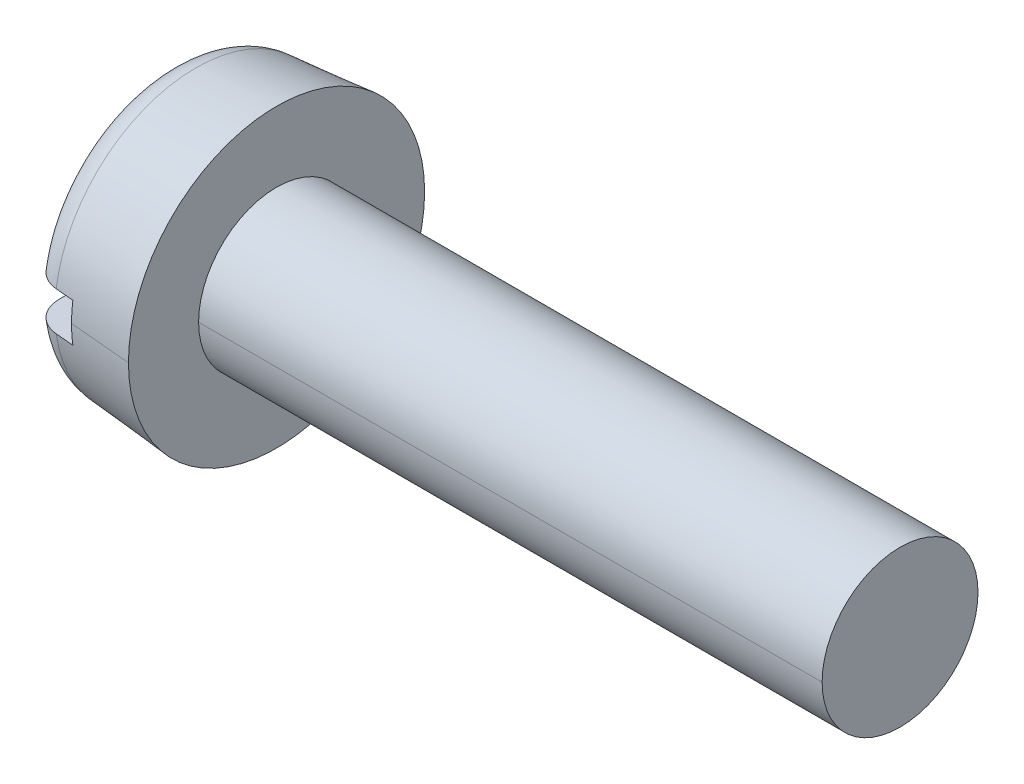
ISO-10303-21;
HEADER;
FILE_DESCRIPTION(('STEP AP214'),'2;1');
FILE_NAME('part.step','',(''),(''),'','','');
FILE_SCHEMA(('AUTOMOTIVE_DESIGN { 1 0 10303 214 1 1 1 1 }'));
ENDSEC;
DATA;
#1=APPLICATION_CONTEXT('core data for automotive mechanical design processes');
#2=APPLICATION_PROTOCOL_DEFINITION('international standard','automotive_design',2000,#1);
#3=PRODUCT_CONTEXT('',#1,'mechanical');
#4=PRODUCT('Part','Part','',(#3));
#5=PRODUCT_RELATED_PRODUCT_CATEGORY('part','',(#4));
#6=PRODUCT_DEFINITION_FORMATION('','',#4);
#7=PRODUCT_DEFINITION_CONTEXT('part definition',#1,'design');
#8=PRODUCT_DEFINITION('design','',#6,#7);
#9=PRODUCT_DEFINITION_SHAPE('','',#8);
#10=(LENGTH_UNIT() NAMED_UNIT(*) SI_UNIT(.MILLI.,.METRE.));
#11=(NAMED_UNIT(*) PLANE_ANGLE_UNIT() SI_UNIT($,.RADIAN.));
#12=(NAMED_UNIT(*) SI_UNIT($,.STERADIAN.) SOLID_ANGLE_UNIT());
#13=UNCERTAINTY_MEASURE_WITH_UNIT(LENGTH_MEASURE(1.E-05),#10,'distance_accuracy_value','');
#14=(GEOMETRIC_REPRESENTATION_CONTEXT(3) GLOBAL_UNCERTAINTY_ASSIGNED_CONTEXT((#13)) GLOBAL_UNIT_ASSIGNED_CONTEXT((#10,
#11,#12)) REPRESENTATION_CONTEXT('',''));
#15=CARTESIAN_POINT('',(0.,0.,0.));
#16=DIRECTION('',(0.,0.,1.));
#17=DIRECTION('',(1.,0.,0.));
#18=AXIS2_PLACEMENT_3D('',#15,#16,#17);
#19=CARTESIAN_POINT('',(0.6,-0.25,-1.9));
#20=DIRECTION('',(0.,-1.,0.));
#21=DIRECTION('',(0.,0.,-1.));
#22=AXIS2_PLACEMENT_3D('',#19,#20,#21);
#23=PLANE('',#22);
#24=CARTESIAN_POINT('',(0.365137702900937,-0.25,-1.79210773290244));
#25=CARTESIAN_POINT('',(0.291437131902306,-0.25,-1.78559733075897));
#26=CARTESIAN_POINT('',(0.22219649316851,-0.25,-1.7512156416243));
#27=CARTESIAN_POINT('',(0.155571204508869,-0.25,-1.71813261401084));
#28=CARTESIAN_POINT('',(0.104145980214715,-0.25,-1.66148344588308));
#29=CARTESIAN_POINT('',(0.0551789764167699,-0.25,-1.60754221239432));
#30=CARTESIAN_POINT('',(0.0271281505162559,-0.25,-1.53493574681391));
#31=CARTESIAN_POINT('',(0.,-0.25,-1.46471752458742));
#32=CARTESIAN_POINT('',(0.,-0.25,-1.38865912274626));
#33=B_SPLINE_CURVE_WITH_KNOTS('',2,(#24,#25,#26,#27,#28,#29,#30,#31,#32),.UNSPECIFIED.,.F.,.F.,
(3,2,2,2,3),(0.,0.25,0.5,0.75,1.),.UNSPECIFIED.);
#34=CARTESIAN_POINT('',(0.365137702900937,-0.25,-1.79210773290244));
#35=VERTEX_POINT('',#34);
#36=CARTESIAN_POINT('',(0.,-0.25,-1.38865912274626));
#37=VERTEX_POINT('',#36);
#38=EDGE_CURVE('E82',#35,#37,#33,.T.);
#39=ORIENTED_EDGE('',*,*,#38,.T.);
#40=DIRECTION('',(0.,0.,1.));
#41=VECTOR('',#40,1.);
#42=CARTESIAN_POINT('',(0.,-0.25,-1.9));
#43=LINE('',#42,#41);
#44=CARTESIAN_POINT('',(0.,-0.25,1.38865912274626));
#45=VERTEX_POINT('',#44);
#46=EDGE_CURVE('E121',#37,#45,#43,.T.);
#47=ORIENTED_EDGE('',*,*,#46,.T.);
#48=CARTESIAN_POINT('',(0.,-0.25,1.38865912274627));
#49=CARTESIAN_POINT('',(0.,-0.25,1.46315447616691));
#50=CARTESIAN_POINT('',(0.0270786285490139,-0.25,1.53498265899196));
#51=CARTESIAN_POINT('',(0.053283148473742,-0.25,1.60449220023733));
#52=CARTESIAN_POINT('',(0.104220023837533,-0.25,1.66156571297043));
#53=CARTESIAN_POINT('',(0.152903956736866,-0.25,1.71611485923006));
#54=CARTESIAN_POINT('',(0.222641905352023,-0.25,1.75136599302031));
#55=CARTESIAN_POINT('',(0.290134778658801,-0.25,1.78548228628779));
#56=CARTESIAN_POINT('',(0.365137702898777,-0.25,1.79210773291097));
#57=B_SPLINE_CURVE_WITH_KNOTS('',2,(#48,#49,#50,#51,#52,#53,#54,#55,#56),.UNSPECIFIED.,.F.,.F.,
(3,2,2,2,3),(0.,0.25,0.5,0.75,1.),.UNSPECIFIED.);
#58=CARTESIAN_POINT('',(0.365137702898778,-0.25,1.79210773291097));
#59=VERTEX_POINT('',#58);
#60=EDGE_CURVE('E137',#45,#59,#57,.T.);
#61=ORIENTED_EDGE('',*,*,#60,.T.);
#62=CARTESIAN_POINT('',(0.6,-0.25,1.8128522259904));
#63=CARTESIAN_POINT('',(0.549769017917673,-0.25,1.80841599358979));
#64=CARTESIAN_POINT('',(0.499538062464663,-0.25,1.8039794596575));
#65=CARTESIAN_POINT('',(0.449307134241759,-0.25,1.7995426174547));
#66=CARTESIAN_POINT('',(0.421250648596907,-0.25,1.79706441918173));
#67=CARTESIAN_POINT('',(0.393194171447115,-0.25,1.79458612473151));
#68=CARTESIAN_POINT('',(0.365137702898778,-0.25,1.79210773291097));
#69=(BOUNDED_CURVE() B_SPLINE_CURVE(3,(#62,#63,#64,#65,#66,#67,#68),.UNSPECIFIED.,.F.,
.F.) B_SPLINE_CURVE_WITH_KNOTS((4,3,4),(0.00319106621206755,0.00334234570568948,
0.00342684286890607),
.UNSPECIFIED.) CURVE() GEOMETRIC_REPRESENTATION_ITEM() RATIONAL_B_SPLINE_CURVE((1.,1.,1.,1.,1.,
1.,1.)) REPRESENTATION_ITEM(''));
#70=CARTESIAN_POINT('',(0.6,-0.25,1.8128522259904));
#71=VERTEX_POINT('',#70);
#72=EDGE_CURVE('E120',#71,#59,#69,.T.);
#73=ORIENTED_EDGE('',*,*,#72,.F.);
#74=DIRECTION('',(0.,0.,1.));
#75=VECTOR('',#74,1.);
#76=CARTESIAN_POINT('',(0.6,-0.25,-1.9));
#77=LINE('',#76,#75);
#78=CARTESIAN_POINT('',(0.6,-0.25,-1.8128522259904));
#79=VERTEX_POINT('',#78);
#80=EDGE_CURVE('E29',#79,#71,#77,.T.);
#81=ORIENTED_EDGE('',*,*,#80,.F.);
#82=CARTESIAN_POINT('',(0.365137702900937,-0.25,-1.79210773290244));
#83=CARTESIAN_POINT('',(0.393194171448044,-0.25,-1.7945861247316));
#84=CARTESIAN_POINT('',(0.421250648597372,-0.25,-1.79706441918177));
#85=CARTESIAN_POINT('',(0.449307134241759,-0.25,-1.7995426174547));
#86=CARTESIAN_POINT('',(0.499538062464663,-0.25,-1.8039794596575));
#87=CARTESIAN_POINT('',(0.549769017917673,-0.25,-1.80841599358979));
#88=CARTESIAN_POINT('',(0.6,-0.25,-1.8128522259904));
#89=(BOUNDED_CURVE() B_SPLINE_CURVE(3,(#82,#83,#84,#85,#86,#87,#88),.UNSPECIFIED.,.F.,
.F.) B_SPLINE_CURVE_WITH_KNOTS((4,3,4),(0.00325784856487656,0.00334234572775568,
0.00349362522084869),
.UNSPECIFIED.) CURVE() GEOMETRIC_REPRESENTATION_ITEM() RATIONAL_B_SPLINE_CURVE((1.,1.,1.,1.,1.,
1.,1.)) REPRESENTATION_ITEM(''));
#90=EDGE_CURVE('E134',#35,#79,#89,.T.);
#91=ORIENTED_EDGE('',*,*,#90,.F.);
#92=EDGE_LOOP('',(#39,#47,#61,#73,#81,#91));
#93=FACE_BOUND('',#92,.T.);
#94=ADVANCED_FACE('F16',(#93),#23,.F.);
#95=CARTESIAN_POINT('',(0.6,0.25,-1.9));
#96=DIRECTION('',(0.,1.,0.));
#97=DIRECTION('',(1.,0.,0.));
#98=AXIS2_PLACEMENT_3D('',#95,#96,#97);
#99=PLANE('',#98);
#100=DIRECTION('',(0.,0.,-1.));
#101=VECTOR('',#100,1.);
#102=CARTESIAN_POINT('',(0.6,0.25,-1.9));
#103=LINE('',#102,#101);
#104=CARTESIAN_POINT('',(0.6,0.25,1.8128522259904));
#105=VERTEX_POINT('',#104);
#106=CARTESIAN_POINT('',(0.6,0.25,-1.8128522259904));
#107=VERTEX_POINT('',#106);
#108=EDGE_CURVE('E11',#105,#107,#103,.T.);
#109=ORIENTED_EDGE('',*,*,#108,.F.);
#110=CARTESIAN_POINT('',(0.365137702900959,0.25,1.79210773290293));
#111=CARTESIAN_POINT('',(0.393194171448087,0.25,1.79458612473161));
#112=CARTESIAN_POINT('',(0.421250648597394,0.25,1.79706441918177));
#113=CARTESIAN_POINT('',(0.449307134241759,0.25,1.7995426174547));
#114=CARTESIAN_POINT('',(0.499538062464663,0.25,1.8039794596575));
#115=CARTESIAN_POINT('',(0.549769017917673,0.25,1.80841599358979));
#116=CARTESIAN_POINT('',(0.6,0.25,1.8128522259904));
#117=(BOUNDED_CURVE() B_SPLINE_CURVE(3,(#110,#111,#112,#113,#114,#115,#116),.UNSPECIFIED.,.F.,
.F.) B_SPLINE_CURVE_WITH_KNOTS((4,3,4),(0.00325784856487663,0.00334234572775568,
0.00349362522084869),
.UNSPECIFIED.) CURVE() GEOMETRIC_REPRESENTATION_ITEM() RATIONAL_B_SPLINE_CURVE((1.,1.,1.,1.,1.,
1.,1.)) REPRESENTATION_ITEM(''));
#118=CARTESIAN_POINT('',(0.365137702900959,0.25,1.79210773290293));
#119=VERTEX_POINT('',#118);
#120=EDGE_CURVE('E515',#119,#105,#117,.T.);
#121=ORIENTED_EDGE('',*,*,#120,.F.);
#122=CARTESIAN_POINT('',(0.365137702900959,0.25,1.79210773290293));
#123=CARTESIAN_POINT('',(0.29185798650255,0.25,1.78563450730545));
#124=CARTESIAN_POINT('',(0.222397826019831,0.25,1.75117859067216));
#125=CARTESIAN_POINT('',(0.155444181685095,0.25,1.71796603873648));
#126=CARTESIAN_POINT('',(0.104194373722597,0.25,1.66153721924653));
#127=CARTESIAN_POINT('',(0.0554327580786059,0.25,1.60784803451385));
#128=CARTESIAN_POINT('',(0.0272203643972849,0.25,1.53472414118304));
#129=CARTESIAN_POINT('',(0.,0.25,1.46417149523968));
#130=CARTESIAN_POINT('',(0.,0.25,1.38865912274627));
#131=B_SPLINE_CURVE_WITH_KNOTS('',2,(#122,#123,#124,#125,#126,#127,#128,#129,#130),
.UNSPECIFIED.,.F.,.F.,(3,2,2,2,3),(0.,0.25,0.5,0.75,1.),.UNSPECIFIED.);
#132=CARTESIAN_POINT('',(0.,0.25,1.38865912274626));
#133=VERTEX_POINT('',#132);
#134=EDGE_CURVE('E207',#119,#133,#131,.T.);
#135=ORIENTED_EDGE('',*,*,#134,.T.);
#136=DIRECTION('',(0.,0.,-1.));
#137=VECTOR('',#136,1.);
#138=CARTESIAN_POINT('',(0.,0.25,-1.9));
#139=LINE('',#138,#137);
#140=CARTESIAN_POINT('',(0.,0.25,-1.38865912274626));
#141=VERTEX_POINT('',#140);
#142=EDGE_CURVE('E553',#133,#141,#139,.T.);
#143=ORIENTED_EDGE('',*,*,#142,.T.);
#144=CARTESIAN_POINT('',(0.,0.25,-1.38865912274626));
#145=CARTESIAN_POINT('',(0.,0.25,-1.46251622227619));
#146=CARTESIAN_POINT('',(0.026960417168731,0.25,-1.5343648727742));
#147=CARTESIAN_POINT('',(0.053195686998227,0.25,-1.60428102877814));
#148=CARTESIAN_POINT('',(0.103966295066659,0.25,-1.66128361495215));
#149=CARTESIAN_POINT('',(0.152590985685726,0.25,-1.71587687712979));
#150=CARTESIAN_POINT('',(0.222580261018464,0.25,-1.75127465267984));
#151=CARTESIAN_POINT('',(0.290233625586207,0.25,-1.78549101801282));
#152=CARTESIAN_POINT('',(0.365137702900937,0.25,-1.79210773290244));
#153=B_SPLINE_CURVE_WITH_KNOTS('',2,(#144,#145,#146,#147,#148,#149,#150,#151,#152),
.UNSPECIFIED.,.F.,.F.,(3,2,2,2,3),(0.,0.25,0.5,0.75,1.),.UNSPECIFIED.);
#154=CARTESIAN_POINT('',(0.365137702900937,0.25,-1.79210773290244));
#155=VERTEX_POINT('',#154);
#156=EDGE_CURVE('E274',#141,#155,#153,.T.);
#157=ORIENTED_EDGE('',*,*,#156,.T.);
#158=CARTESIAN_POINT('',(0.6,0.25,-1.8128522259904));
#159=CARTESIAN_POINT('',(0.549769017917673,0.25,-1.80841599358979));
#160=CARTESIAN_POINT('',(0.499538062464663,0.25,-1.8039794596575));
#161=CARTESIAN_POINT('',(0.449307134241759,0.25,-1.7995426174547));
#162=CARTESIAN_POINT('',(0.421250648597372,0.25,-1.79706441918177));
#163=CARTESIAN_POINT('',(0.393194171448044,0.25,-1.7945861247316));
#164=CARTESIAN_POINT('',(0.365137702900937,0.25,-1.79210773290244));
#165=(BOUNDED_CURVE() B_SPLINE_CURVE(3,(#158,#159,#160,#161,#162,#163,#164),.UNSPECIFIED.,.F.,
.F.) B_SPLINE_CURVE_WITH_KNOTS((4,3,4),(0.00319106621206755,0.00334234570568948,
0.00342684286890468),
.UNSPECIFIED.) CURVE() GEOMETRIC_REPRESENTATION_ITEM() RATIONAL_B_SPLINE_CURVE((1.,1.,1.,1.,1.,
1.,1.)) REPRESENTATION_ITEM(''));
#166=EDGE_CURVE('E106',#107,#155,#165,.T.);
#167=ORIENTED_EDGE('',*,*,#166,.F.);
#168=EDGE_LOOP('',(#109,#121,#135,#143,#157,#167));
#169=FACE_BOUND('',#168,.T.);
#170=ADVANCED_FACE('F155',(#169),#99,.F.);
#171=CARTESIAN_POINT('',(0.6,-0.25,-1.9));
#172=DIRECTION('',(-1.,0.,0.));
#173=DIRECTION('',(0.,0.,1.));
#174=AXIS2_PLACEMENT_3D('',#171,#172,#173);
#175=PLANE('',#174);
#176=CARTESIAN_POINT('',(0.6,0.,0.));
#177=DIRECTION('',(-1.,0.,0.));
#178=DIRECTION('',(0.,0.,1.));
#179=AXIS2_PLACEMENT_3D('',#176,#177,#178);
#180=CIRCLE('',#179,1.83000906917926);
#181=CARTESIAN_POINT('',(0.6,0.,-1.83000906917926));
#182=VERTEX_POINT('',#181);
#183=EDGE_CURVE('E102',#107,#182,#180,.T.);
#184=ORIENTED_EDGE('',*,*,#183,.T.);
#185=CARTESIAN_POINT('',(0.6,0.,0.));
#186=DIRECTION('',(-1.,0.,0.));
#187=DIRECTION('',(0.,0.,1.));
#188=AXIS2_PLACEMENT_3D('',#185,#186,#187);
#189=CIRCLE('',#188,1.83000906917926);
#190=EDGE_CURVE('E126',#182,#79,#189,.T.);
#191=ORIENTED_EDGE('',*,*,#190,.T.);
#192=ORIENTED_EDGE('',*,*,#80,.T.);
#193=CARTESIAN_POINT('',(0.6,0.,0.));
#194=DIRECTION('',(-1.,0.,0.));
#195=DIRECTION('',(0.,0.,1.));
#196=AXIS2_PLACEMENT_3D('',#193,#194,#195);
#197=CIRCLE('',#196,1.83000906917926);
#198=CARTESIAN_POINT('',(0.6,0.,1.83000906917926));
#199=VERTEX_POINT('',#198);
#200=EDGE_CURVE('E116',#71,#199,#197,.T.);
#201=ORIENTED_EDGE('',*,*,#200,.T.);
#202=CARTESIAN_POINT('',(0.6,0.,0.));
#203=DIRECTION('',(-1.,0.,0.));
#204=DIRECTION('',(0.,0.,1.));
#205=AXIS2_PLACEMENT_3D('',#202,#203,#204);
#206=CIRCLE('',#205,1.83000906917926);
#207=EDGE_CURVE('E91',#199,#105,#206,.T.);
#208=ORIENTED_EDGE('',*,*,#207,.T.);
#209=ORIENTED_EDGE('',*,*,#108,.T.);
#210=EDGE_LOOP('',(#184,#191,#192,#201,#208,#209));
#211=FACE_BOUND('',#210,.T.);
#212=ADVANCED_FACE('F187',(#211),#175,.T.);
#213=CARTESIAN_POINT('',(0.4,0.,0.));
#214=DIRECTION('',(1.,0.,0.));
#215=DIRECTION('',(0.,0.,-1.));
#216=AXIS2_PLACEMENT_3D('',#213,#214,#215);
#217=TOROIDAL_SURFACE('',#216,1.41098340145674,0.4);
#218=ORIENTED_EDGE('',*,*,#38,.F.);
#219=CARTESIAN_POINT('',(0.365137702900937,0.,0.));
#220=DIRECTION('',(1.,0.,0.));
#221=DIRECTION('',(0.,0.,1.));
#222=AXIS2_PLACEMENT_3D('',#219,#220,#221);
#223=CIRCLE('',#222,1.80946128069343);
#224=EDGE_CURVE('E210',#59,#35,#223,.T.);
#225=ORIENTED_EDGE('',*,*,#224,.F.);
#226=ORIENTED_EDGE('',*,*,#60,.F.);
#227=CARTESIAN_POINT('',(0.,0.,0.));
#228=DIRECTION('',(-1.,0.,0.));
#229=DIRECTION('',(0.,0.,-1.));
#230=AXIS2_PLACEMENT_3D('',#227,#228,#229);
#231=CIRCLE('',#230,1.41098340145674);
#232=EDGE_CURVE('E201',#37,#45,#231,.T.);
#233=ORIENTED_EDGE('',*,*,#232,.F.);
#234=EDGE_LOOP('',(#218,#225,#226,#233));
#235=FACE_BOUND('',#234,.T.);
#236=ADVANCED_FACE('F178',(#235),#217,.T.);
#237=CARTESIAN_POINT('',(9.4,1.,0.));
#238=DIRECTION('',(-1.,0.,0.));
#239=DIRECTION('',(0.,0.,1.));
#240=AXIS2_PLACEMENT_3D('',#237,#238,#239);
#241=PLANE('',#240);
#242=CARTESIAN_POINT('',(9.4,0.,0.));
#243=DIRECTION('',(-1.,0.,0.));
#244=DIRECTION('',(0.,0.,1.));
#245=AXIS2_PLACEMENT_3D('',#242,#243,#244);
#246=CIRCLE('',#245,1.);
#247=CARTESIAN_POINT('',(9.4,0.,1.));
#248=VERTEX_POINT('',#247);
#249=CARTESIAN_POINT('',(9.4,0.,-1.));
#250=VERTEX_POINT('',#249);
#251=EDGE_CURVE('E87',#248,#250,#246,.T.);
#252=ORIENTED_EDGE('',*,*,#251,.F.);
#253=CARTESIAN_POINT('',(9.4,0.,0.));
#254=DIRECTION('',(-1.,0.,0.));
#255=DIRECTION('',(0.,0.,1.));
#256=AXIS2_PLACEMENT_3D('',#253,#254,#255);
#257=CIRCLE('',#256,1.);
#258=EDGE_CURVE('E64',#250,#248,#257,.T.);
#259=ORIENTED_EDGE('',*,*,#258,.F.);
#260=EDGE_LOOP('',(#252,#259));
#261=FACE_BOUND('',#260,.T.);
#262=ADVANCED_FACE('F93',(#261),#241,.F.);
#263=CARTESIAN_POINT('',(0.,0.,0.));
#264=DIRECTION('',(-1.,0.,0.));
#265=DIRECTION('',(0.,0.,1.));
#266=AXIS2_PLACEMENT_3D('',#263,#264,#265);
#267=CYLINDRICAL_SURFACE('',#266,1.);
#268=DIRECTION('',(-1.,0.,0.));
#269=VECTOR('',#268,1.);
#270=CARTESIAN_POINT('',(0.,0.,-1.));
#271=LINE('',#270,#269);
#272=CARTESIAN_POINT('',(1.4,0.,-1.));
#273=VERTEX_POINT('',#272);
#274=EDGE_CURVE('E79',#250,#273,#271,.T.);
#275=ORIENTED_EDGE('',*,*,#274,.F.);
#276=ORIENTED_EDGE('',*,*,#258,.T.);
#277=DIRECTION('',(-1.,0.,0.));
#278=VECTOR('',#277,1.);
#279=CARTESIAN_POINT('',(0.,0.,1.));
#280=LINE('',#279,#278);
#281=CARTESIAN_POINT('',(1.4,0.,1.));
#282=VERTEX_POINT('',#281);
#283=EDGE_CURVE('E76',#248,#282,#280,.T.);
#284=ORIENTED_EDGE('',*,*,#283,.T.);
#285=CARTESIAN_POINT('',(1.4,0.,0.));
#286=DIRECTION('',(-1.,0.,0.));
#287=DIRECTION('',(0.,0.,1.));
#288=AXIS2_PLACEMENT_3D('',#285,#286,#287);
#289=CIRCLE('',#288,1.);
#290=EDGE_CURVE('E83',#273,#282,#289,.T.);
#291=ORIENTED_EDGE('',*,*,#290,.F.);
#292=EDGE_LOOP('',(#275,#276,#284,#291));
#293=FACE_BOUND('',#292,.T.);
#294=ADVANCED_FACE('F75',(#293),#267,.T.);
#295=CARTESIAN_POINT('',(1.4,1.9,0.));
#296=DIRECTION('',(-1.,0.,0.));
#297=DIRECTION('',(0.,0.,1.));
#298=AXIS2_PLACEMENT_3D('',#295,#296,#297);
#299=PLANE('',#298);
#300=CARTESIAN_POINT('',(1.4,0.,0.));
#301=DIRECTION('',(-1.,0.,0.));
#302=DIRECTION('',(0.,0.,1.));
#303=AXIS2_PLACEMENT_3D('',#300,#301,#302);
#304=CIRCLE('',#303,1.);
#305=EDGE_CURVE('E89',#282,#273,#304,.T.);
#306=ORIENTED_EDGE('',*,*,#305,.T.);
#307=ORIENTED_EDGE('',*,*,#290,.T.);
#308=EDGE_LOOP('',(#306,#307));
#309=FACE_BOUND('',#308,.T.);
#310=CARTESIAN_POINT('',(1.4,0.,0.));
#311=DIRECTION('',(-1.,0.,0.));
#312=DIRECTION('',(0.,0.,1.));
#313=AXIS2_PLACEMENT_3D('',#310,#311,#312);
#314=CIRCLE('',#313,1.9);
#315=CARTESIAN_POINT('',(1.4,0.,-1.9));
#316=VERTEX_POINT('',#315);
#317=CARTESIAN_POINT('',(1.4,0.,1.9));
#318=VERTEX_POINT('',#317);
#319=EDGE_CURVE('E122',#316,#318,#314,.T.);
#320=ORIENTED_EDGE('',*,*,#319,.F.);
#321=CARTESIAN_POINT('',(1.4,0.,0.));
#322=DIRECTION('',(-1.,0.,0.));
#323=DIRECTION('',(0.,0.,1.));
#324=AXIS2_PLACEMENT_3D('',#321,#322,#323);
#325=CIRCLE('',#324,1.9);
#326=EDGE_CURVE('E114',#318,#316,#325,.T.);
#327=ORIENTED_EDGE('',*,*,#326,.F.);
#328=EDGE_LOOP('',(#320,#327));
#329=FACE_BOUND('',#328,.T.);
#330=ADVANCED_FACE('F280',(#309,#329),#299,.F.);
#331=CARTESIAN_POINT('',(1.4,0.,0.));
#332=DIRECTION('',(1.,0.,0.));
#333=DIRECTION('',(0.,0.,-1.));
#334=AXIS2_PLACEMENT_3D('',#331,#332,#333);
#335=CONICAL_SURFACE('',#334,1.9,0.0872664625997163);
#336=DIRECTION('',(0.996194698091746,0.,0.0871557427476584));
#337=VECTOR('',#336,1.);
#338=CARTESIAN_POINT('',(1.4,0.,1.9));
#339=LINE('',#338,#337);
#340=EDGE_CURVE('E111',#199,#318,#339,.T.);
#341=ORIENTED_EDGE('',*,*,#340,.F.);
#342=ORIENTED_EDGE('',*,*,#200,.F.);
#343=ORIENTED_EDGE('',*,*,#72,.T.);
#344=ORIENTED_EDGE('',*,*,#224,.T.);
#345=ORIENTED_EDGE('',*,*,#90,.T.);
#346=ORIENTED_EDGE('',*,*,#190,.F.);
#347=DIRECTION('',(0.996194698091746,0.,-0.0871557427476584));
#348=VECTOR('',#347,1.);
#349=CARTESIAN_POINT('',(1.4,0.,-1.9));
#350=LINE('',#349,#348);
#351=EDGE_CURVE('E107',#182,#316,#350,.T.);
#352=ORIENTED_EDGE('',*,*,#351,.T.);
#353=ORIENTED_EDGE('',*,*,#319,.T.);
#354=EDGE_LOOP('',(#341,#342,#343,#344,#345,#346,#352,#353));
#355=FACE_BOUND('',#354,.T.);
#356=ADVANCED_FACE('F18',(#355),#335,.T.);
#357=CARTESIAN_POINT('',(0.,0.,0.));
#358=DIRECTION('',(1.,0.,0.));
#359=DIRECTION('',(0.,1.,0.));
#360=AXIS2_PLACEMENT_3D('',#357,#358,#359);
#361=PLANE('',#360);
#362=ORIENTED_EDGE('',*,*,#232,.T.);
#363=ORIENTED_EDGE('',*,*,#46,.F.);
#364=EDGE_LOOP('',(#362,#363));
#365=FACE_BOUND('',#364,.T.);
#366=ADVANCED_FACE('F239',(#365),#361,.F.);
#367=CARTESIAN_POINT('',(0.4,0.,0.));
#368=DIRECTION('',(1.,0.,0.));
#369=DIRECTION('',(0.,0.,-1.));
#370=AXIS2_PLACEMENT_3D('',#367,#368,#369);
#371=TOROIDAL_SURFACE('',#370,1.41098340145674,0.4);
#372=ORIENTED_EDGE('',*,*,#156,.F.);
#373=CARTESIAN_POINT('',(0.,0.,0.));
#374=DIRECTION('',(-1.,0.,0.));
#375=DIRECTION('',(0.,0.,-1.));
#376=AXIS2_PLACEMENT_3D('',#373,#374,#375);
#377=CIRCLE('',#376,1.41098340145674);
#378=EDGE_CURVE('E543',#133,#141,#377,.T.);
#379=ORIENTED_EDGE('',*,*,#378,.F.);
#380=ORIENTED_EDGE('',*,*,#134,.F.);
#381=CARTESIAN_POINT('',(0.365137702900937,0.,0.));
#382=DIRECTION('',(1.,0.,0.));
#383=DIRECTION('',(0.,0.,1.));
#384=AXIS2_PLACEMENT_3D('',#381,#382,#383);
#385=CIRCLE('',#384,1.80946128069343);
#386=EDGE_CURVE('E506',#155,#119,#385,.T.);
#387=ORIENTED_EDGE('',*,*,#386,.F.);
#388=EDGE_LOOP('',(#372,#379,#380,#387));
#389=FACE_BOUND('',#388,.T.);
#390=ADVANCED_FACE('F309',(#389),#371,.T.);
#391=CARTESIAN_POINT('',(0.,0.,0.));
#392=DIRECTION('',(1.,0.,0.));
#393=DIRECTION('',(0.,1.,0.));
#394=AXIS2_PLACEMENT_3D('',#391,#392,#393);
#395=PLANE('',#394);
#396=ORIENTED_EDGE('',*,*,#378,.T.);
#397=ORIENTED_EDGE('',*,*,#142,.F.);
#398=EDGE_LOOP('',(#396,#397));
#399=FACE_BOUND('',#398,.T.);
#400=ADVANCED_FACE('F300',(#399),#395,.F.);
#401=CARTESIAN_POINT('',(1.4,0.,0.));
#402=DIRECTION('',(1.,0.,0.));
#403=DIRECTION('',(0.,0.,-1.));
#404=AXIS2_PLACEMENT_3D('',#401,#402,#403);
#405=CONICAL_SURFACE('',#404,1.9,0.0872664625997163);
#406=ORIENTED_EDGE('',*,*,#207,.F.);
#407=ORIENTED_EDGE('',*,*,#340,.T.);
#408=ORIENTED_EDGE('',*,*,#326,.T.);
#409=ORIENTED_EDGE('',*,*,#351,.F.);
#410=ORIENTED_EDGE('',*,*,#183,.F.);
#411=ORIENTED_EDGE('',*,*,#166,.T.);
#412=ORIENTED_EDGE('',*,*,#386,.T.);
#413=ORIENTED_EDGE('',*,*,#120,.T.);
#414=EDGE_LOOP('',(#406,#407,#408,#409,#410,#411,#412,#413));
#415=FACE_BOUND('',#414,.T.);
#416=ADVANCED_FACE('F292',(#415),#405,.T.);
#417=CARTESIAN_POINT('',(0.,0.,0.));
#418=DIRECTION('',(-1.,0.,0.));
#419=DIRECTION('',(0.,0.,1.));
#420=AXIS2_PLACEMENT_3D('',#417,#418,#419);
#421=CYLINDRICAL_SURFACE('',#420,1.);
#422=ORIENTED_EDGE('',*,*,#251,.T.);
#423=ORIENTED_EDGE('',*,*,#274,.T.);
#424=ORIENTED_EDGE('',*,*,#305,.F.);
#425=ORIENTED_EDGE('',*,*,#283,.F.);
#426=EDGE_LOOP('',(#422,#423,#424,#425));
#427=FACE_BOUND('',#426,.T.);
#428=ADVANCED_FACE('F86',(#427),#421,.T.);
#429=CLOSED_SHELL('',(#94,#170,#212,#236,#262,#294,#330,#356,#366,#390,#400,#416,#428));
#430=MANIFOLD_SOLID_BREP('B1',#429);
#431=ADVANCED_BREP_SHAPE_REPRESENTATION('',(#18,#430),#14);
#432=SHAPE_DEFINITION_REPRESENTATION(#9,#431);
ENDSEC;
END-ISO-10303-21;
